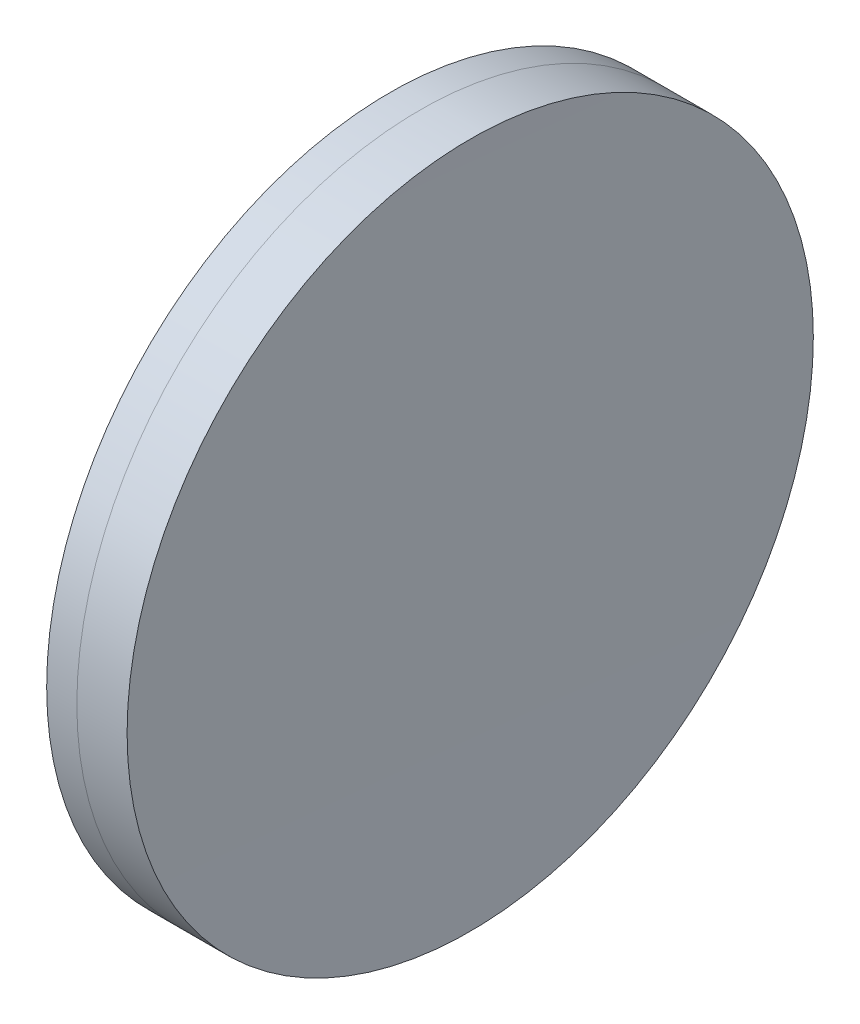
ISO-10303-21;
HEADER;
FILE_DESCRIPTION(('STEP AP214'),'2;1');
FILE_NAME('part.step','',(''),(''),'','','');
FILE_SCHEMA(('AUTOMOTIVE_DESIGN { 1 0 10303 214 1 1 1 1 }'));
ENDSEC;
DATA;
#1=APPLICATION_CONTEXT('core data for automotive mechanical design processes');
#2=APPLICATION_PROTOCOL_DEFINITION('international standard','automotive_design',2000,#1);
#3=PRODUCT_CONTEXT('',#1,'mechanical');
#4=PRODUCT('Part','Part','',(#3));
#5=PRODUCT_RELATED_PRODUCT_CATEGORY('part','',(#4));
#6=PRODUCT_DEFINITION_FORMATION('','',#4);
#7=PRODUCT_DEFINITION_CONTEXT('part definition',#1,'design');
#8=PRODUCT_DEFINITION('design','',#6,#7);
#9=PRODUCT_DEFINITION_SHAPE('','',#8);
#10=(LENGTH_UNIT() NAMED_UNIT(*) SI_UNIT(.MILLI.,.METRE.));
#11=(NAMED_UNIT(*) PLANE_ANGLE_UNIT() SI_UNIT($,.RADIAN.));
#12=(NAMED_UNIT(*) SI_UNIT($,.STERADIAN.) SOLID_ANGLE_UNIT());
#13=UNCERTAINTY_MEASURE_WITH_UNIT(LENGTH_MEASURE(1.E-05),#10,'distance_accuracy_value','');
#14=(GEOMETRIC_REPRESENTATION_CONTEXT(3) GLOBAL_UNCERTAINTY_ASSIGNED_CONTEXT((#13)) GLOBAL_UNIT_ASSIGNED_CONTEXT((#10,
#11,#12)) REPRESENTATION_CONTEXT('',''));
#15=CARTESIAN_POINT('',(0.,0.,0.));
#16=DIRECTION('',(0.,0.,1.));
#17=DIRECTION('',(1.,0.,0.));
#18=AXIS2_PLACEMENT_3D('',#15,#16,#17);
#19=CARTESIAN_POINT('',(-321.350924128296,0.,0.));
#20=DIRECTION('',(-1.,0.,0.));
#21=DIRECTION('',(0.,0.,1.));
#22=AXIS2_PLACEMENT_3D('',#19,#20,#21);
#23=SPHERICAL_SURFACE('',#22,291.1);
#24=CARTESIAN_POINT('',(-31.3611829304389,0.,0.));
#25=DIRECTION('',(-1.,0.,0.));
#26=DIRECTION('',(0.,0.,1.));
#27=AXIS2_PLACEMENT_3D('',#24,#25,#26);
#28=CIRCLE('',#27,25.4);
#29=CARTESIAN_POINT('',(-31.3611829304389,0.,25.4));
#30=VERTEX_POINT('',#29);
#31=EDGE_CURVE('E11',#30,#30,#28,.T.);
#32=ORIENTED_EDGE('',*,*,#31,.T.);
#33=EDGE_LOOP('',(#32));
#34=FACE_BOUND('',#33,.T.);
#35=ADVANCED_FACE('F45',(#34),#23,.F.);
#36=CARTESIAN_POINT('',(-151.128475118145,0.,0.));
#37=DIRECTION('',(-1.,0.,0.));
#38=DIRECTION('',(0.,0.,1.));
#39=AXIS2_PLACEMENT_3D('',#36,#37,#38);
#40=CYLINDRICAL_SURFACE('',#39,25.3999999999999);
#41=CARTESIAN_POINT('',(-27.6400697831609,0.,0.));
#42=DIRECTION('',(-1.,0.,0.));
#43=DIRECTION('',(0.,0.,1.));
#44=AXIS2_PLACEMENT_3D('',#41,#42,#43);
#45=CIRCLE('',#44,25.3999999999998);
#46=CARTESIAN_POINT('',(-27.6400697831609,0.,25.3999999999998));
#47=VERTEX_POINT('',#46);
#48=EDGE_CURVE('E51',#47,#47,#45,.T.);
#49=ORIENTED_EDGE('',*,*,#48,.T.);
#50=EDGE_LOOP('',(#49));
#51=FACE_BOUND('',#50,.T.);
#52=ORIENTED_EDGE('',*,*,#31,.F.);
#53=EDGE_LOOP('',(#52));
#54=FACE_BOUND('',#53,.T.);
#55=ADVANCED_FACE('F57',(#51,#54),#40,.T.);
#56=CARTESIAN_POINT('',(2882.2490758717,0.,0.));
#57=DIRECTION('',(-1.,0.,0.));
#58=DIRECTION('',(0.,0.,-1.));
#59=AXIS2_PLACEMENT_3D('',#56,#57,#58);
#60=SPHERICAL_SURFACE('',#59,2910.);
#61=ORIENTED_EDGE('',*,*,#48,.F.);
#62=EDGE_LOOP('',(#61));
#63=FACE_BOUND('',#62,.T.);
#64=ADVANCED_FACE('F60',(#63),#60,.F.);
#65=CLOSED_SHELL('',(#35,#55,#64));
#66=MANIFOLD_SOLID_BREP('B2',#65);
#67=CARTESIAN_POINT('',(342.349075871704,0.,0.));
#68=DIRECTION('',(-1.,0.,0.));
#69=DIRECTION('',(0.,0.,1.));
#70=AXIS2_PLACEMENT_3D('',#67,#68,#69);
#71=SPHERICAL_SURFACE('',#70,376.8);
#72=CARTESIAN_POINT('',(-33.5938453277778,0.,0.));
#73=DIRECTION('',(-1.,0.,0.));
#74=DIRECTION('',(0.,0.,1.));
#75=AXIS2_PLACEMENT_3D('',#72,#73,#74);
#76=CIRCLE('',#75,25.4);
#77=CARTESIAN_POINT('',(-33.5938453277778,0.,25.4));
#78=VERTEX_POINT('',#77);
#79=EDGE_CURVE('E44',#78,#78,#76,.T.);
#80=ORIENTED_EDGE('',*,*,#79,.T.);
#81=EDGE_LOOP('',(#80));
#82=FACE_BOUND('',#81,.T.);
#83=ADVANCED_FACE('F86',(#82),#71,.T.);
#84=CARTESIAN_POINT('',(-402.021265572877,0.,0.));
#85=DIRECTION('',(-1.,0.,0.));
#86=DIRECTION('',(0.,0.,1.));
#87=AXIS2_PLACEMENT_3D('',#84,#85,#86);
#88=CYLINDRICAL_SURFACE('',#87,25.4);
#89=CARTESIAN_POINT('',(-31.3611829304388,0.,0.));
#90=DIRECTION('',(-1.,0.,0.));
#91=DIRECTION('',(0.,0.,1.));
#92=AXIS2_PLACEMENT_3D('',#89,#90,#91);
#93=CIRCLE('',#92,25.4);
#94=CARTESIAN_POINT('',(-31.3611829304388,0.,25.4));
#95=VERTEX_POINT('',#94);
#96=EDGE_CURVE('E92',#95,#95,#93,.T.);
#97=ORIENTED_EDGE('',*,*,#96,.T.);
#98=EDGE_LOOP('',(#97));
#99=FACE_BOUND('',#98,.T.);
#100=ORIENTED_EDGE('',*,*,#79,.F.);
#101=EDGE_LOOP('',(#100));
#102=FACE_BOUND('',#101,.T.);
#103=ADVANCED_FACE('F98',(#99,#102),#88,.T.);
#104=CARTESIAN_POINT('',(-321.350924128296,0.,0.));
#105=DIRECTION('',(-1.,0.,0.));
#106=DIRECTION('',(0.,0.,1.));
#107=AXIS2_PLACEMENT_3D('',#104,#105,#106);
#108=SPHERICAL_SURFACE('',#107,291.1);
#109=ORIENTED_EDGE('',*,*,#96,.F.);
#110=EDGE_LOOP('',(#109));
#111=FACE_BOUND('',#110,.T.);
#112=ADVANCED_FACE('F101',(#111),#108,.T.);
#113=CLOSED_SHELL('',(#83,#103,#112));
#114=MANIFOLD_SOLID_BREP('B6',#113);
#115=ADVANCED_BREP_SHAPE_REPRESENTATION('',(#18,#66,#114),#14);
#116=SHAPE_DEFINITION_REPRESENTATION(#9,#115);
ENDSEC;
END-ISO-10303-21;
